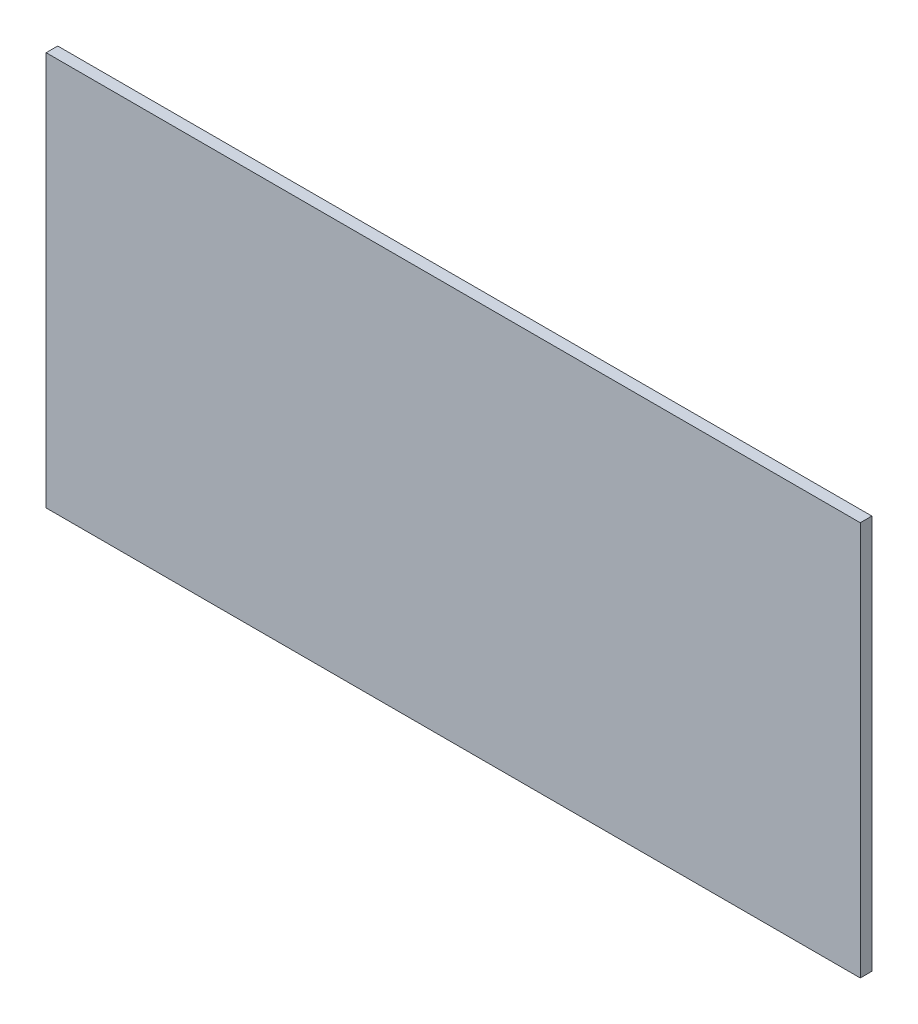
ISO-10303-21;
HEADER;
FILE_DESCRIPTION(('STEP AP214'),'2;1');
FILE_NAME('part.step','',(''),(''),'','','');
FILE_SCHEMA(('AUTOMOTIVE_DESIGN { 1 0 10303 214 1 1 1 1 }'));
ENDSEC;
DATA;
#1=APPLICATION_CONTEXT('core data for automotive mechanical design processes');
#2=APPLICATION_PROTOCOL_DEFINITION('international standard','automotive_design',2000,#1);
#3=PRODUCT_CONTEXT('',#1,'mechanical');
#4=PRODUCT('Part','Part','',(#3));
#5=PRODUCT_RELATED_PRODUCT_CATEGORY('part','',(#4));
#6=PRODUCT_DEFINITION_FORMATION('','',#4);
#7=PRODUCT_DEFINITION_CONTEXT('part definition',#1,'design');
#8=PRODUCT_DEFINITION('design','',#6,#7);
#9=PRODUCT_DEFINITION_SHAPE('','',#8);
#10=(LENGTH_UNIT() NAMED_UNIT(*) SI_UNIT(.MILLI.,.METRE.));
#11=(NAMED_UNIT(*) PLANE_ANGLE_UNIT() SI_UNIT($,.RADIAN.));
#12=(NAMED_UNIT(*) SI_UNIT($,.STERADIAN.) SOLID_ANGLE_UNIT());
#13=UNCERTAINTY_MEASURE_WITH_UNIT(LENGTH_MEASURE(1.E-05),#10,'distance_accuracy_value','');
#14=(GEOMETRIC_REPRESENTATION_CONTEXT(3) GLOBAL_UNCERTAINTY_ASSIGNED_CONTEXT((#13)) GLOBAL_UNIT_ASSIGNED_CONTEXT((#10,
#11,#12)) REPRESENTATION_CONTEXT('',''));
#15=CARTESIAN_POINT('',(0.,0.,0.));
#16=DIRECTION('',(0.,0.,1.));
#17=DIRECTION('',(1.,0.,0.));
#18=AXIS2_PLACEMENT_3D('',#15,#16,#17);
#19=CARTESIAN_POINT('',(0.,0.,1.5875));
#20=DIRECTION('',(1.,0.,0.));
#21=DIRECTION('',(0.,0.,-1.));
#22=AXIS2_PLACEMENT_3D('',#19,#20,#21);
#23=PLANE('',#22);
#24=DIRECTION('',(0.,-1.,0.));
#25=VECTOR('',#24,1.);
#26=CARTESIAN_POINT('',(0.,0.,0.));
#27=LINE('',#26,#25);
#28=CARTESIAN_POINT('',(0.,54.,0.));
#29=VERTEX_POINT('',#28);
#30=CARTESIAN_POINT('',(0.,0.,0.));
#31=VERTEX_POINT('',#30);
#32=EDGE_CURVE('E95',#29,#31,#27,.T.);
#33=ORIENTED_EDGE('',*,*,#32,.T.);
#34=DIRECTION('',(0.,0.,-1.));
#35=VECTOR('',#34,1.);
#36=CARTESIAN_POINT('',(0.,0.,1.5875));
#37=LINE('',#36,#35);
#38=CARTESIAN_POINT('',(0.,0.,1.5875));
#39=VERTEX_POINT('',#38);
#40=EDGE_CURVE('E11',#39,#31,#37,.T.);
#41=ORIENTED_EDGE('',*,*,#40,.F.);
#42=DIRECTION('',(0.,-1.,0.));
#43=VECTOR('',#42,1.);
#44=CARTESIAN_POINT('',(0.,0.,1.5875));
#45=LINE('',#44,#43);
#46=CARTESIAN_POINT('',(0.,54.,1.5875));
#47=VERTEX_POINT('',#46);
#48=EDGE_CURVE('E83',#47,#39,#45,.T.);
#49=ORIENTED_EDGE('',*,*,#48,.F.);
#50=DIRECTION('',(0.,0.,-1.));
#51=VECTOR('',#50,1.);
#52=CARTESIAN_POINT('',(0.,54.,1.5875));
#53=LINE('',#52,#51);
#54=EDGE_CURVE('E91',#47,#29,#53,.T.);
#55=ORIENTED_EDGE('',*,*,#54,.T.);
#56=EDGE_LOOP('',(#33,#41,#49,#55));
#57=FACE_BOUND('',#56,.T.);
#58=ADVANCED_FACE('F32',(#57),#23,.F.);
#59=CARTESIAN_POINT('',(0.,0.,1.5875));
#60=DIRECTION('',(0.,1.,0.));
#61=DIRECTION('',(0.,0.,1.));
#62=AXIS2_PLACEMENT_3D('',#59,#60,#61);
#63=PLANE('',#62);
#64=DIRECTION('',(1.,0.,0.));
#65=VECTOR('',#64,1.);
#66=CARTESIAN_POINT('',(0.,0.,0.));
#67=LINE('',#66,#65);
#68=CARTESIAN_POINT('',(111.5,0.,0.));
#69=VERTEX_POINT('',#68);
#70=EDGE_CURVE('E87',#31,#69,#67,.T.);
#71=ORIENTED_EDGE('',*,*,#70,.T.);
#72=DIRECTION('',(0.,0.,-1.));
#73=VECTOR('',#72,1.);
#74=CARTESIAN_POINT('',(111.5,0.,1.5875));
#75=LINE('',#74,#73);
#76=CARTESIAN_POINT('',(111.5,0.,1.5875));
#77=VERTEX_POINT('',#76);
#78=EDGE_CURVE('E40',#77,#69,#75,.T.);
#79=ORIENTED_EDGE('',*,*,#78,.F.);
#80=DIRECTION('',(1.,0.,0.));
#81=VECTOR('',#80,1.);
#82=CARTESIAN_POINT('',(0.,0.,1.5875));
#83=LINE('',#82,#81);
#84=EDGE_CURVE('E78',#39,#77,#83,.T.);
#85=ORIENTED_EDGE('',*,*,#84,.F.);
#86=ORIENTED_EDGE('',*,*,#40,.T.);
#87=EDGE_LOOP('',(#71,#79,#85,#86));
#88=FACE_BOUND('',#87,.T.);
#89=ADVANCED_FACE('F86',(#88),#63,.F.);
#90=CARTESIAN_POINT('',(111.5,0.,1.5875));
#91=DIRECTION('',(-1.,0.,0.));
#92=DIRECTION('',(0.,0.,1.));
#93=AXIS2_PLACEMENT_3D('',#90,#91,#92);
#94=PLANE('',#93);
#95=DIRECTION('',(0.,1.,0.));
#96=VECTOR('',#95,1.);
#97=CARTESIAN_POINT('',(111.5,0.,0.));
#98=LINE('',#97,#96);
#99=CARTESIAN_POINT('',(111.5,54.,0.));
#100=VERTEX_POINT('',#99);
#101=EDGE_CURVE('E65',#69,#100,#98,.T.);
#102=ORIENTED_EDGE('',*,*,#101,.T.);
#103=DIRECTION('',(0.,0.,-1.));
#104=VECTOR('',#103,1.);
#105=CARTESIAN_POINT('',(111.5,54.,1.5875));
#106=LINE('',#105,#104);
#107=CARTESIAN_POINT('',(111.5,54.,1.5875));
#108=VERTEX_POINT('',#107);
#109=EDGE_CURVE('E88',#108,#100,#106,.T.);
#110=ORIENTED_EDGE('',*,*,#109,.F.);
#111=DIRECTION('',(0.,1.,0.));
#112=VECTOR('',#111,1.);
#113=CARTESIAN_POINT('',(111.5,0.,1.5875));
#114=LINE('',#113,#112);
#115=EDGE_CURVE('E81',#77,#108,#114,.T.);
#116=ORIENTED_EDGE('',*,*,#115,.F.);
#117=ORIENTED_EDGE('',*,*,#78,.T.);
#118=EDGE_LOOP('',(#102,#110,#116,#117));
#119=FACE_BOUND('',#118,.T.);
#120=ADVANCED_FACE('F89',(#119),#94,.F.);
#121=CARTESIAN_POINT('',(0.,54.,1.5875));
#122=DIRECTION('',(0.,-1.,0.));
#123=DIRECTION('',(0.,0.,-1.));
#124=AXIS2_PLACEMENT_3D('',#121,#122,#123);
#125=PLANE('',#124);
#126=DIRECTION('',(-1.,0.,0.));
#127=VECTOR('',#126,1.);
#128=CARTESIAN_POINT('',(0.,54.,0.));
#129=LINE('',#128,#127);
#130=EDGE_CURVE('E71',#100,#29,#129,.T.);
#131=ORIENTED_EDGE('',*,*,#130,.T.);
#132=ORIENTED_EDGE('',*,*,#54,.F.);
#133=DIRECTION('',(-1.,0.,0.));
#134=VECTOR('',#133,1.);
#135=CARTESIAN_POINT('',(0.,54.,1.5875));
#136=LINE('',#135,#134);
#137=EDGE_CURVE('E48',#108,#47,#136,.T.);
#138=ORIENTED_EDGE('',*,*,#137,.F.);
#139=ORIENTED_EDGE('',*,*,#109,.T.);
#140=EDGE_LOOP('',(#131,#132,#138,#139));
#141=FACE_BOUND('',#140,.T.);
#142=ADVANCED_FACE('F102',(#141),#125,.F.);
#143=CARTESIAN_POINT('',(0.,54.,1.5875));
#144=DIRECTION('',(0.,0.,-1.));
#145=DIRECTION('',(-1.,0.,0.));
#146=AXIS2_PLACEMENT_3D('',#143,#144,#145);
#147=PLANE('',#146);
#148=ORIENTED_EDGE('',*,*,#48,.T.);
#149=ORIENTED_EDGE('',*,*,#84,.T.);
#150=ORIENTED_EDGE('',*,*,#115,.T.);
#151=ORIENTED_EDGE('',*,*,#137,.T.);
#152=EDGE_LOOP('',(#148,#149,#150,#151));
#153=FACE_BOUND('',#152,.T.);
#154=ADVANCED_FACE('F79',(#153),#147,.F.);
#155=CARTESIAN_POINT('',(0.,54.,0.));
#156=DIRECTION('',(0.,0.,-1.));
#157=DIRECTION('',(-1.,0.,0.));
#158=AXIS2_PLACEMENT_3D('',#155,#156,#157);
#159=PLANE('',#158);
#160=ORIENTED_EDGE('',*,*,#32,.F.);
#161=ORIENTED_EDGE('',*,*,#130,.F.);
#162=ORIENTED_EDGE('',*,*,#101,.F.);
#163=ORIENTED_EDGE('',*,*,#70,.F.);
#164=EDGE_LOOP('',(#160,#161,#162,#163));
#165=FACE_BOUND('',#164,.T.);
#166=ADVANCED_FACE('F105',(#165),#159,.T.);
#167=CLOSED_SHELL('',(#58,#89,#120,#142,#154,#166));
#168=MANIFOLD_SOLID_BREP('B2',#167);
#169=ADVANCED_BREP_SHAPE_REPRESENTATION('',(#18,#168),#14);
#170=SHAPE_DEFINITION_REPRESENTATION(#9,#169);
ENDSEC;
END-ISO-10303-21;
